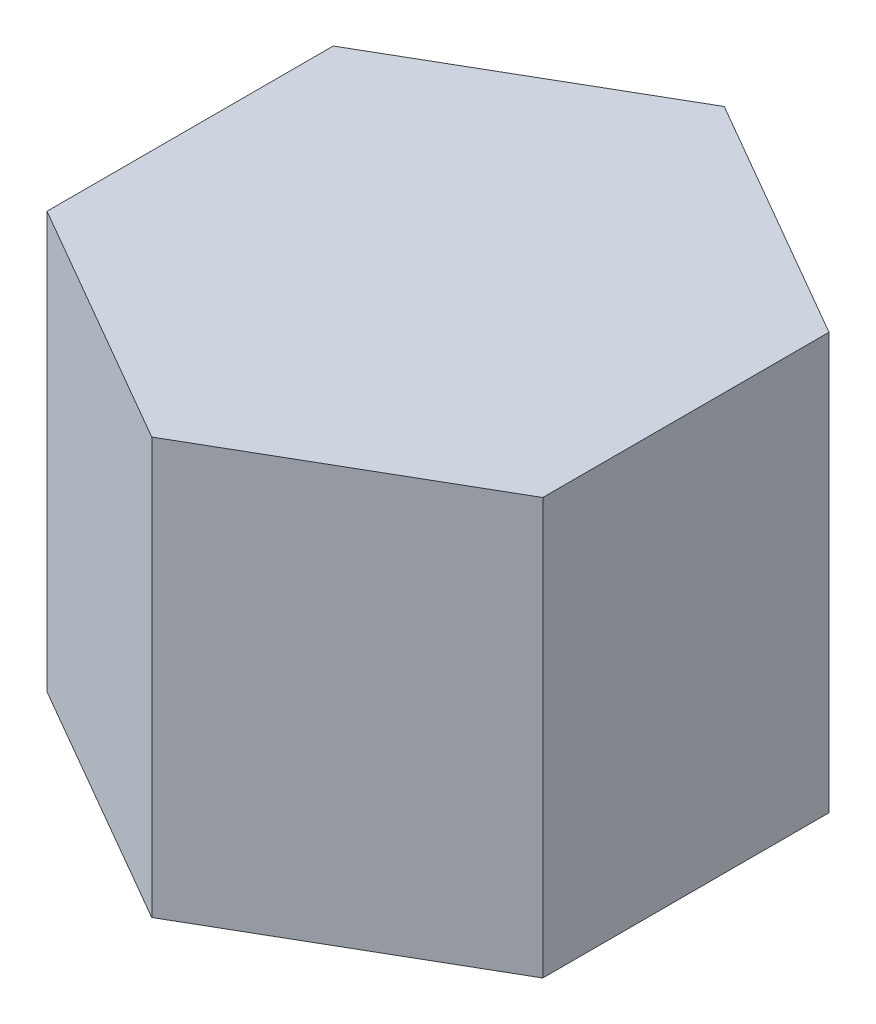
ISO-10303-21;
HEADER;
FILE_DESCRIPTION(('STEP AP214'),'2;1');
FILE_NAME('part.step','',(''),(''),'','','');
FILE_SCHEMA(('AUTOMOTIVE_DESIGN { 1 0 10303 214 1 1 1 1 }'));
ENDSEC;
DATA;
#1=APPLICATION_CONTEXT('core data for automotive mechanical design processes');
#2=APPLICATION_PROTOCOL_DEFINITION('international standard','automotive_design',2000,#1);
#3=PRODUCT_CONTEXT('',#1,'mechanical');
#4=PRODUCT('Part','Part','',(#3));
#5=PRODUCT_RELATED_PRODUCT_CATEGORY('part','',(#4));
#6=PRODUCT_DEFINITION_FORMATION('','',#4);
#7=PRODUCT_DEFINITION_CONTEXT('part definition',#1,'design');
#8=PRODUCT_DEFINITION('design','',#6,#7);
#9=PRODUCT_DEFINITION_SHAPE('','',#8);
#10=(LENGTH_UNIT() NAMED_UNIT(*) SI_UNIT(.MILLI.,.METRE.));
#11=(NAMED_UNIT(*) PLANE_ANGLE_UNIT() SI_UNIT($,.RADIAN.));
#12=(NAMED_UNIT(*) SI_UNIT($,.STERADIAN.) SOLID_ANGLE_UNIT());
#13=UNCERTAINTY_MEASURE_WITH_UNIT(LENGTH_MEASURE(1.E-05),#10,'distance_accuracy_value','');
#14=(GEOMETRIC_REPRESENTATION_CONTEXT(3) GLOBAL_UNCERTAINTY_ASSIGNED_CONTEXT((#13)) GLOBAL_UNIT_ASSIGNED_CONTEXT((#10,
#11,#12)) REPRESENTATION_CONTEXT('',''));
#15=CARTESIAN_POINT('',(0.,0.,0.));
#16=DIRECTION('',(0.,0.,1.));
#17=DIRECTION('',(1.,0.,0.));
#18=AXIS2_PLACEMENT_3D('',#15,#16,#17);
#19=CARTESIAN_POINT('',(204.339551417382,-147.556598747966,288.217869605357));
#20=DIRECTION('',(-0.499999999999943,0.,-0.866025403784471));
#21=DIRECTION('',(-0.866025403784471,0.,0.499999999999943));
#22=AXIS2_PLACEMENT_3D('',#19,#20,#21);
#23=PLANE('',#22);
#24=CARTESIAN_POINT('',(204.642660308706,-147.047793579175,288.042869605357));
#25=DIRECTION('',(-0.866025403784471,0.,0.499999999999943));
#26=VECTOR('',#25,1.);
#27=LINE('',#24,#26);
#28=CARTESIAN_POINT('',(204.642660308706,-147.047793579175,288.042869605357));
#29=VERTEX_POINT('',#28);
#30=CARTESIAN_POINT('',(204.339551417382,-147.047793579175,288.217869605357));
#31=VERTEX_POINT('',#30);
#32=EDGE_CURVE('E170',#29,#31,#27,.T.);
#33=ORIENTED_EDGE('',*,*,#32,.T.);
#34=CARTESIAN_POINT('',(204.339551417382,-147.556598747966,288.217869605357));
#35=DIRECTION('',(0.,1.,0.));
#36=VECTOR('',#35,1.);
#37=LINE('',#34,#36);
#38=CARTESIAN_POINT('',(204.339551417382,-147.556598747966,288.217869605357));
#39=VERTEX_POINT('',#38);
#40=EDGE_CURVE('E35',#39,#31,#37,.T.);
#41=ORIENTED_EDGE('',*,*,#40,.F.);
#42=CARTESIAN_POINT('',(204.642660308706,-147.556598747966,288.042869605357));
#43=DIRECTION('',(-0.866025403784471,0.,0.499999999999943));
#44=VECTOR('',#43,1.);
#45=LINE('',#42,#44);
#46=CARTESIAN_POINT('',(204.642660308706,-147.556598747966,288.042869605357));
#47=VERTEX_POINT('',#46);
#48=EDGE_CURVE('E159',#47,#39,#45,.T.);
#49=ORIENTED_EDGE('',*,*,#48,.F.);
#50=CARTESIAN_POINT('',(204.642660308706,-147.556598747966,288.042869605357));
#51=DIRECTION('',(0.,1.,0.));
#52=VECTOR('',#51,1.);
#53=LINE('',#50,#52);
#54=EDGE_CURVE('E10',#47,#29,#53,.T.);
#55=ORIENTED_EDGE('',*,*,#54,.T.);
#56=EDGE_LOOP('',(#33,#41,#49,#55));
#57=FACE_BOUND('',#56,.T.);
#58=ADVANCED_FACE('F16',(#57),#23,.F.);
#59=CARTESIAN_POINT('',(204.642660308706,-147.556598747966,291.594471220494));
#60=DIRECTION('',(-1.,0.,0.));
#61=DIRECTION('',(0.,-1.,0.));
#62=AXIS2_PLACEMENT_3D('',#59,#60,#61);
#63=PLANE('',#62);
#64=CARTESIAN_POINT('',(204.642660308706,-147.047793579175,287.692869605357));
#65=DIRECTION('',(0.,0.,1.));
#66=VECTOR('',#65,1.);
#67=LINE('',#64,#66);
#68=CARTESIAN_POINT('',(204.642660308706,-147.047793579175,287.692869605357));
#69=VERTEX_POINT('',#68);
#70=EDGE_CURVE('E167',#69,#29,#67,.T.);
#71=ORIENTED_EDGE('',*,*,#70,.T.);
#72=ORIENTED_EDGE('',*,*,#54,.F.);
#73=CARTESIAN_POINT('',(204.642660308706,-147.556598747966,287.692869605357));
#74=DIRECTION('',(0.,0.,1.));
#75=VECTOR('',#74,1.);
#76=LINE('',#73,#75);
#77=CARTESIAN_POINT('',(204.642660308706,-147.556598747966,287.692869605357));
#78=VERTEX_POINT('',#77);
#79=EDGE_CURVE('E156',#78,#47,#76,.T.);
#80=ORIENTED_EDGE('',*,*,#79,.F.);
#81=CARTESIAN_POINT('',(204.642660308706,-147.556598747966,287.692869605357));
#82=DIRECTION('',(0.,1.,0.));
#83=VECTOR('',#82,1.);
#84=LINE('',#81,#83);
#85=EDGE_CURVE('E27',#78,#69,#84,.T.);
#86=ORIENTED_EDGE('',*,*,#85,.T.);
#87=EDGE_LOOP('',(#71,#72,#80,#86));
#88=FACE_BOUND('',#87,.T.);
#89=ADVANCED_FACE('F189',(#88),#63,.F.);
#90=CARTESIAN_POINT('',(204.642660308706,-147.556598747966,287.692869605357));
#91=DIRECTION('',(-0.499999999999943,0.,0.866025403784471));
#92=DIRECTION('',(0.866025403784471,0.,0.499999999999943));
#93=AXIS2_PLACEMENT_3D('',#90,#91,#92);
#94=PLANE('',#93);
#95=CARTESIAN_POINT('',(204.339551417382,-147.047793579175,287.517869605357));
#96=DIRECTION('',(0.866025403784471,0.,0.499999999999943));
#97=VECTOR('',#96,1.);
#98=LINE('',#95,#97);
#99=CARTESIAN_POINT('',(204.339551417382,-147.047793579175,287.517869605357));
#100=VERTEX_POINT('',#99);
#101=EDGE_CURVE('E163',#100,#69,#98,.T.);
#102=ORIENTED_EDGE('',*,*,#101,.T.);
#103=ORIENTED_EDGE('',*,*,#85,.F.);
#104=CARTESIAN_POINT('',(204.339551417382,-147.556598747966,287.517869605357));
#105=DIRECTION('',(0.866025403784471,0.,0.499999999999943));
#106=VECTOR('',#105,1.);
#107=LINE('',#104,#106);
#108=CARTESIAN_POINT('',(204.339551417382,-147.556598747966,287.517869605357));
#109=VERTEX_POINT('',#108);
#110=EDGE_CURVE('E106',#109,#78,#107,.T.);
#111=ORIENTED_EDGE('',*,*,#110,.F.);
#112=CARTESIAN_POINT('',(204.339551417382,-147.556598747966,287.517869605357));
#113=DIRECTION('',(0.,1.,0.));
#114=VECTOR('',#113,1.);
#115=LINE('',#112,#114);
#116=EDGE_CURVE('E94',#109,#100,#115,.T.);
#117=ORIENTED_EDGE('',*,*,#116,.T.);
#118=EDGE_LOOP('',(#102,#103,#111,#117));
#119=FACE_BOUND('',#118,.T.);
#120=ADVANCED_FACE('F198',(#119),#94,.F.);
#121=CARTESIAN_POINT('',(204.339551417382,-147.556598747966,287.517869605357));
#122=DIRECTION('',(0.499999999999978,0.,0.866025403784452));
#123=DIRECTION('',(0.866025403784452,0.,-0.499999999999978));
#124=AXIS2_PLACEMENT_3D('',#121,#122,#123);
#125=PLANE('',#124);
#126=CARTESIAN_POINT('',(204.036442526057,-147.047793579175,287.692869605357));
#127=DIRECTION('',(0.866025403784452,0.,-0.499999999999978));
#128=VECTOR('',#127,1.);
#129=LINE('',#126,#128);
#130=CARTESIAN_POINT('',(204.036442526057,-147.047793579175,287.692869605357));
#131=VERTEX_POINT('',#130);
#132=EDGE_CURVE('E162',#131,#100,#129,.T.);
#133=ORIENTED_EDGE('',*,*,#132,.T.);
#134=ORIENTED_EDGE('',*,*,#116,.F.);
#135=CARTESIAN_POINT('',(204.036442526057,-147.556598747966,287.692869605357));
#136=DIRECTION('',(0.866025403784452,0.,-0.499999999999978));
#137=VECTOR('',#136,1.);
#138=LINE('',#135,#137);
#139=CARTESIAN_POINT('',(204.036442526057,-147.556598747966,287.692869605357));
#140=VERTEX_POINT('',#139);
#141=EDGE_CURVE('E98',#140,#109,#138,.T.);
#142=ORIENTED_EDGE('',*,*,#141,.F.);
#143=CARTESIAN_POINT('',(204.036442526057,-147.556598747966,287.692869605357));
#144=DIRECTION('',(0.,1.,0.));
#145=VECTOR('',#144,1.);
#146=LINE('',#143,#145);
#147=EDGE_CURVE('E79',#140,#131,#146,.T.);
#148=ORIENTED_EDGE('',*,*,#147,.T.);
#149=EDGE_LOOP('',(#133,#134,#142,#148));
#150=FACE_BOUND('',#149,.T.);
#151=ADVANCED_FACE('F100',(#150),#125,.F.);
#152=CARTESIAN_POINT('',(204.036442526057,-147.556598747966,291.594471220494));
#153=DIRECTION('',(1.,0.,0.));
#154=DIRECTION('',(0.,1.,0.));
#155=AXIS2_PLACEMENT_3D('',#152,#153,#154);
#156=PLANE('',#155);
#157=CARTESIAN_POINT('',(204.036442526057,-147.047793579175,288.042869605357));
#158=DIRECTION('',(0.,0.,-1.));
#159=VECTOR('',#158,1.);
#160=LINE('',#157,#159);
#161=CARTESIAN_POINT('',(204.036442526057,-147.047793579175,288.042869605357));
#162=VERTEX_POINT('',#161);
#163=EDGE_CURVE('E88',#162,#131,#160,.T.);
#164=ORIENTED_EDGE('',*,*,#163,.T.);
#165=ORIENTED_EDGE('',*,*,#147,.F.);
#166=CARTESIAN_POINT('',(204.036442526057,-147.556598747966,288.042869605357));
#167=DIRECTION('',(0.,0.,-1.));
#168=VECTOR('',#167,1.);
#169=LINE('',#166,#168);
#170=CARTESIAN_POINT('',(204.036442526057,-147.556598747966,288.042869605357));
#171=VERTEX_POINT('',#170);
#172=EDGE_CURVE('E84',#171,#140,#169,.T.);
#173=ORIENTED_EDGE('',*,*,#172,.F.);
#174=CARTESIAN_POINT('',(204.036442526057,-147.556598747966,288.042869605357));
#175=DIRECTION('',(0.,1.,0.));
#176=VECTOR('',#175,1.);
#177=LINE('',#174,#176);
#178=EDGE_CURVE('E58',#171,#162,#177,.T.);
#179=ORIENTED_EDGE('',*,*,#178,.T.);
#180=EDGE_LOOP('',(#164,#165,#173,#179));
#181=FACE_BOUND('',#180,.T.);
#182=ADVANCED_FACE('F82',(#181),#156,.F.);
#183=CARTESIAN_POINT('',(204.036442526057,-147.556598747966,288.042869605357));
#184=DIRECTION('',(0.499999999999978,0.,-0.866025403784452));
#185=DIRECTION('',(-0.866025403784452,0.,-0.499999999999978));
#186=AXIS2_PLACEMENT_3D('',#183,#184,#185);
#187=PLANE('',#186);
#188=CARTESIAN_POINT('',(204.339551417382,-147.047793579175,288.217869605357));
#189=DIRECTION('',(-0.866025403784452,0.,-0.499999999999978));
#190=VECTOR('',#189,1.);
#191=LINE('',#188,#190);
#192=EDGE_CURVE('E160',#31,#162,#191,.T.);
#193=ORIENTED_EDGE('',*,*,#192,.T.);
#194=ORIENTED_EDGE('',*,*,#178,.F.);
#195=CARTESIAN_POINT('',(204.339551417382,-147.556598747966,288.217869605357));
#196=DIRECTION('',(-0.866025403784452,0.,-0.499999999999978));
#197=VECTOR('',#196,1.);
#198=LINE('',#195,#197);
#199=EDGE_CURVE('E112',#39,#171,#198,.T.);
#200=ORIENTED_EDGE('',*,*,#199,.F.);
#201=ORIENTED_EDGE('',*,*,#40,.T.);
#202=EDGE_LOOP('',(#193,#194,#200,#201));
#203=FACE_BOUND('',#202,.T.);
#204=ADVANCED_FACE('F131',(#203),#187,.F.);
#205=CARTESIAN_POINT('',(206.491105863044,-147.556598747966,291.594471220494));
#206=DIRECTION('',(0.,1.,0.));
#207=DIRECTION('',(-1.,0.,0.));
#208=AXIS2_PLACEMENT_3D('',#205,#206,#207);
#209=PLANE('',#208);
#210=ORIENTED_EDGE('',*,*,#48,.T.);
#211=ORIENTED_EDGE('',*,*,#199,.T.);
#212=ORIENTED_EDGE('',*,*,#172,.T.);
#213=ORIENTED_EDGE('',*,*,#141,.T.);
#214=ORIENTED_EDGE('',*,*,#110,.T.);
#215=ORIENTED_EDGE('',*,*,#79,.T.);
#216=EDGE_LOOP('',(#210,#211,#212,#213,#214,#215));
#217=FACE_BOUND('',#216,.T.);
#218=ADVANCED_FACE('F111',(#217),#209,.F.);
#219=CARTESIAN_POINT('',(206.491105863044,-147.047793579175,291.594471220494));
#220=DIRECTION('',(0.,1.,0.));
#221=DIRECTION('',(-1.,0.,0.));
#222=AXIS2_PLACEMENT_3D('',#219,#220,#221);
#223=PLANE('',#222);
#224=ORIENTED_EDGE('',*,*,#32,.F.);
#225=ORIENTED_EDGE('',*,*,#70,.F.);
#226=ORIENTED_EDGE('',*,*,#101,.F.);
#227=ORIENTED_EDGE('',*,*,#132,.F.);
#228=ORIENTED_EDGE('',*,*,#163,.F.);
#229=ORIENTED_EDGE('',*,*,#192,.F.);
#230=EDGE_LOOP('',(#224,#225,#226,#227,#228,#229));
#231=FACE_BOUND('',#230,.T.);
#232=ADVANCED_FACE('F130',(#231),#223,.T.);
#233=CLOSED_SHELL('',(#58,#89,#120,#151,#182,#204,#218,#232));
#234=MANIFOLD_SOLID_BREP('B1',#233);
#235=ADVANCED_BREP_SHAPE_REPRESENTATION('',(#18,#234),#14);
#236=SHAPE_DEFINITION_REPRESENTATION(#9,#235);
ENDSEC;
END-ISO-10303-21;
